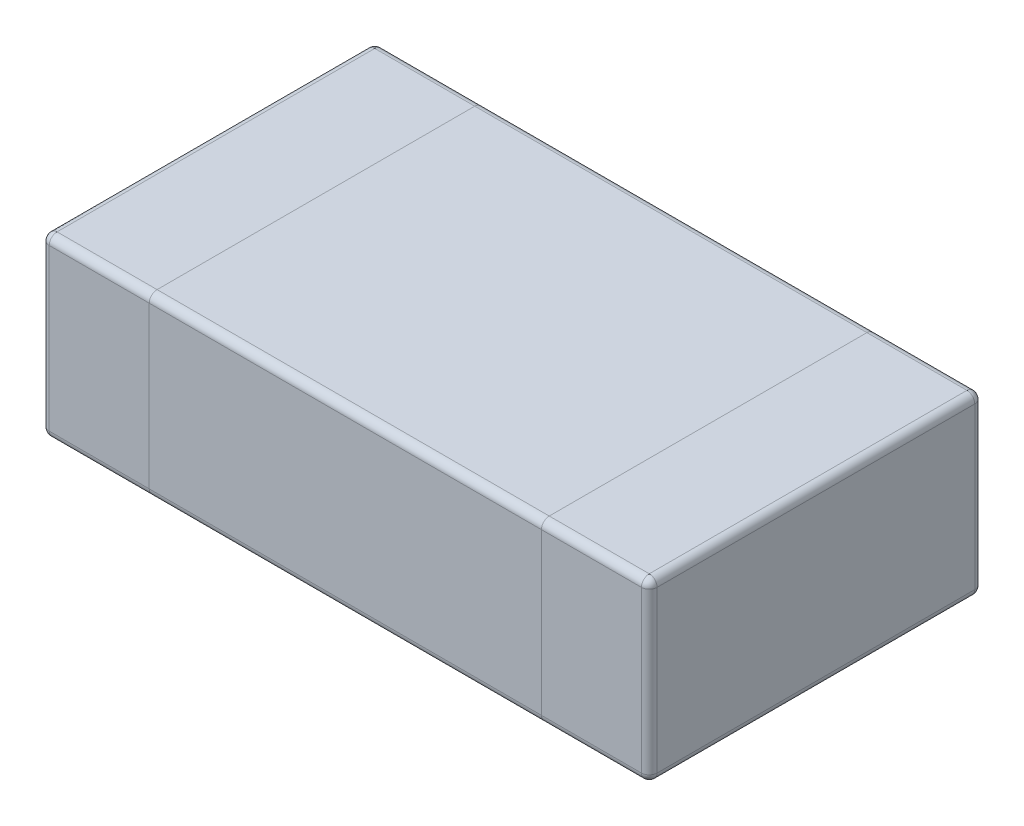
ISO-10303-21;
HEADER;
FILE_DESCRIPTION(('STEP AP214'),'2;1');
FILE_NAME('part.step','',(''),(''),'','','');
FILE_SCHEMA(('AUTOMOTIVE_DESIGN { 1 0 10303 214 1 1 1 1 }'));
ENDSEC;
DATA;
#1=APPLICATION_CONTEXT('core data for automotive mechanical design processes');
#2=APPLICATION_PROTOCOL_DEFINITION('international standard','automotive_design',2000,#1);
#3=PRODUCT_CONTEXT('',#1,'mechanical');
#4=PRODUCT('Part','Part','',(#3));
#5=PRODUCT_RELATED_PRODUCT_CATEGORY('part','',(#4));
#6=PRODUCT_DEFINITION_FORMATION('','',#4);
#7=PRODUCT_DEFINITION_CONTEXT('part definition',#1,'design');
#8=PRODUCT_DEFINITION('design','',#6,#7);
#9=PRODUCT_DEFINITION_SHAPE('','',#8);
#10=(LENGTH_UNIT() NAMED_UNIT(*) SI_UNIT(.MILLI.,.METRE.));
#11=(NAMED_UNIT(*) PLANE_ANGLE_UNIT() SI_UNIT($,.RADIAN.));
#12=(NAMED_UNIT(*) SI_UNIT($,.STERADIAN.) SOLID_ANGLE_UNIT());
#13=UNCERTAINTY_MEASURE_WITH_UNIT(LENGTH_MEASURE(1.E-05),#10,'distance_accuracy_value','');
#14=(GEOMETRIC_REPRESENTATION_CONTEXT(3) GLOBAL_UNCERTAINTY_ASSIGNED_CONTEXT((#13)) GLOBAL_UNIT_ASSIGNED_CONTEXT((#10,
#11,#12)) REPRESENTATION_CONTEXT('',''));
#15=CARTESIAN_POINT('',(0.,0.,0.));
#16=DIRECTION('',(0.,0.,1.));
#17=DIRECTION('',(1.,0.,0.));
#18=AXIS2_PLACEMENT_3D('',#15,#16,#17);
#19=CARTESIAN_POINT('',(-0.755,-0.225,0.405));
#20=DIRECTION('',(0.,1.,0.));
#21=DIRECTION('',(0.,0.,1.));
#22=AXIS2_PLACEMENT_3D('',#19,#20,#21);
#23=PLANE('',#22);
#24=DIRECTION('',(0.,0.,-1.));
#25=VECTOR('',#24,1.);
#26=CARTESIAN_POINT('',(-0.5,-0.225,0.405));
#27=LINE('',#26,#25);
#28=CARTESIAN_POINT('',(-0.5,-0.225,0.405));
#29=VERTEX_POINT('',#28);
#30=CARTESIAN_POINT('',(-0.5,-0.225,-0.405));
#31=VERTEX_POINT('',#30);
#32=EDGE_CURVE('E209',#29,#31,#27,.T.);
#33=ORIENTED_EDGE('',*,*,#32,.F.);
#34=DIRECTION('',(1.,0.,0.));
#35=VECTOR('',#34,1.);
#36=CARTESIAN_POINT('',(-0.755,-0.225,0.405));
#37=LINE('',#36,#35);
#38=CARTESIAN_POINT('',(-0.755,-0.225,0.405));
#39=VERTEX_POINT('',#38);
#40=EDGE_CURVE('E232',#29,#39,#37,.F.);
#41=ORIENTED_EDGE('',*,*,#40,.T.);
#42=DIRECTION('',(0.,0.,1.));
#43=VECTOR('',#42,1.);
#44=CARTESIAN_POINT('',(-0.755,-0.225,0.405));
#45=LINE('',#44,#43);
#46=CARTESIAN_POINT('',(-0.755,-0.225,-0.405));
#47=VERTEX_POINT('',#46);
#48=EDGE_CURVE('E230',#39,#47,#45,.F.);
#49=ORIENTED_EDGE('',*,*,#48,.T.);
#50=DIRECTION('',(-1.,0.,0.));
#51=VECTOR('',#50,1.);
#52=CARTESIAN_POINT('',(-0.755,-0.225,-0.405));
#53=LINE('',#52,#51);
#54=EDGE_CURVE('E228',#47,#31,#53,.F.);
#55=ORIENTED_EDGE('',*,*,#54,.T.);
#56=EDGE_LOOP('',(#33,#41,#49,#55));
#57=FACE_BOUND('',#56,.T.);
#58=ADVANCED_FACE('F38',(#57),#23,.F.);
#59=DIRECTION('',(0.,0.,-1.));
#60=VECTOR('',#59,1.);
#61=CARTESIAN_POINT('',(0.5,-0.225,0.405));
#62=LINE('',#61,#60);
#63=CARTESIAN_POINT('',(0.5,-0.225,0.405));
#64=VERTEX_POINT('',#63);
#65=CARTESIAN_POINT('',(0.5,-0.225,-0.405));
#66=VERTEX_POINT('',#65);
#67=EDGE_CURVE('E215',#64,#66,#62,.T.);
#68=ORIENTED_EDGE('',*,*,#67,.F.);
#69=DIRECTION('',(1.,0.,0.));
#70=VECTOR('',#69,1.);
#71=CARTESIAN_POINT('',(-0.755,-0.225,0.405));
#72=LINE('',#71,#70);
#73=EDGE_CURVE('E220',#64,#29,#72,.F.);
#74=ORIENTED_EDGE('',*,*,#73,.T.);
#75=ORIENTED_EDGE('',*,*,#32,.T.);
#76=DIRECTION('',(-1.,0.,0.));
#77=VECTOR('',#76,1.);
#78=CARTESIAN_POINT('',(-0.755,-0.225,-0.405));
#79=LINE('',#78,#77);
#80=EDGE_CURVE('E211',#31,#66,#79,.F.);
#81=ORIENTED_EDGE('',*,*,#80,.T.);
#82=EDGE_LOOP('',(#68,#74,#75,#81));
#83=FACE_BOUND('',#82,.T.);
#84=ADVANCED_FACE('F446',(#83),#23,.F.);
#85=CARTESIAN_POINT('',(-0.755,0.225,-0.425));
#86=DIRECTION('',(0.,0.,1.));
#87=DIRECTION('',(1.,0.,0.));
#88=AXIS2_PLACEMENT_3D('',#85,#86,#87);
#89=PLANE('',#88);
#90=DIRECTION('',(0.,-1.,0.));
#91=VECTOR('',#90,1.);
#92=CARTESIAN_POINT('',(0.5,0.225,-0.425));
#93=LINE('',#92,#91);
#94=CARTESIAN_POINT('',(0.5,0.205,-0.425));
#95=VERTEX_POINT('',#94);
#96=CARTESIAN_POINT('',(0.5,-0.205,-0.425));
#97=VERTEX_POINT('',#96);
#98=EDGE_CURVE('E195',#95,#97,#93,.T.);
#99=ORIENTED_EDGE('',*,*,#98,.T.);
#100=DIRECTION('',(-1.,0.,0.));
#101=VECTOR('',#100,1.);
#102=CARTESIAN_POINT('',(-0.755,-0.205,-0.425));
#103=LINE('',#102,#101);
#104=CARTESIAN_POINT('',(-0.5,-0.205,-0.425));
#105=VERTEX_POINT('',#104);
#106=EDGE_CURVE('E252',#97,#105,#103,.T.);
#107=ORIENTED_EDGE('',*,*,#106,.T.);
#108=DIRECTION('',(0.,-1.,0.));
#109=VECTOR('',#108,1.);
#110=CARTESIAN_POINT('',(-0.5,0.225,-0.425));
#111=LINE('',#110,#109);
#112=CARTESIAN_POINT('',(-0.5,0.205,-0.425));
#113=VERTEX_POINT('',#112);
#114=EDGE_CURVE('E402',#113,#105,#111,.T.);
#115=ORIENTED_EDGE('',*,*,#114,.F.);
#116=DIRECTION('',(-1.,0.,0.));
#117=VECTOR('',#116,1.);
#118=CARTESIAN_POINT('',(0.5,0.205,-0.425));
#119=LINE('',#118,#117);
#120=EDGE_CURVE('E250',#113,#95,#119,.F.);
#121=ORIENTED_EDGE('',*,*,#120,.T.);
#122=EDGE_LOOP('',(#99,#107,#115,#121));
#123=FACE_BOUND('',#122,.T.);
#124=ADVANCED_FACE('F507',(#123),#89,.F.);
#125=DIRECTION('',(0.,-1.,0.));
#126=VECTOR('',#125,1.);
#127=CARTESIAN_POINT('',(0.755,0.225,-0.425));
#128=LINE('',#127,#126);
#129=CARTESIAN_POINT('',(0.755,0.205,-0.425));
#130=VERTEX_POINT('',#129);
#131=CARTESIAN_POINT('',(0.755,-0.205,-0.425));
#132=VERTEX_POINT('',#131);
#133=EDGE_CURVE('E367',#130,#132,#128,.T.);
#134=ORIENTED_EDGE('',*,*,#133,.T.);
#135=DIRECTION('',(-1.,0.,0.));
#136=VECTOR('',#135,1.);
#137=CARTESIAN_POINT('',(-0.755,-0.205,-0.425));
#138=LINE('',#137,#136);
#139=EDGE_CURVE('E256',#132,#97,#138,.T.);
#140=ORIENTED_EDGE('',*,*,#139,.T.);
#141=ORIENTED_EDGE('',*,*,#98,.F.);
#142=DIRECTION('',(-1.,0.,0.));
#143=VECTOR('',#142,1.);
#144=CARTESIAN_POINT('',(0.755,0.205,-0.425));
#145=LINE('',#144,#143);
#146=EDGE_CURVE('E254',#95,#130,#145,.F.);
#147=ORIENTED_EDGE('',*,*,#146,.T.);
#148=EDGE_LOOP('',(#134,#140,#141,#147));
#149=FACE_BOUND('',#148,.T.);
#150=ADVANCED_FACE('F366',(#149),#89,.F.);
#151=CARTESIAN_POINT('',(-0.755,0.225,0.425));
#152=DIRECTION('',(0.,0.,-1.));
#153=DIRECTION('',(-1.,0.,0.));
#154=AXIS2_PLACEMENT_3D('',#151,#152,#153);
#155=PLANE('',#154);
#156=DIRECTION('',(0.,-1.,0.));
#157=VECTOR('',#156,1.);
#158=CARTESIAN_POINT('',(-0.5,0.225,0.425));
#159=LINE('',#158,#157);
#160=CARTESIAN_POINT('',(-0.5,0.205,0.425));
#161=VERTEX_POINT('',#160);
#162=CARTESIAN_POINT('',(-0.5,-0.205,0.425));
#163=VERTEX_POINT('',#162);
#164=EDGE_CURVE('E196',#161,#163,#159,.T.);
#165=ORIENTED_EDGE('',*,*,#164,.T.);
#166=DIRECTION('',(1.,0.,0.));
#167=VECTOR('',#166,1.);
#168=CARTESIAN_POINT('',(-0.755,-0.205,0.425));
#169=LINE('',#168,#167);
#170=CARTESIAN_POINT('',(0.5,-0.205,0.425));
#171=VERTEX_POINT('',#170);
#172=EDGE_CURVE('E193',#163,#171,#169,.T.);
#173=ORIENTED_EDGE('',*,*,#172,.T.);
#174=DIRECTION('',(0.,-1.,0.));
#175=VECTOR('',#174,1.);
#176=CARTESIAN_POINT('',(0.5,0.225,0.425));
#177=LINE('',#176,#175);
#178=CARTESIAN_POINT('',(0.5,0.205,0.425));
#179=VERTEX_POINT('',#178);
#180=EDGE_CURVE('E178',#179,#171,#177,.T.);
#181=ORIENTED_EDGE('',*,*,#180,.F.);
#182=DIRECTION('',(1.,0.,0.));
#183=VECTOR('',#182,1.);
#184=CARTESIAN_POINT('',(-0.5,0.205,0.425));
#185=LINE('',#184,#183);
#186=EDGE_CURVE('E190',#179,#161,#185,.F.);
#187=ORIENTED_EDGE('',*,*,#186,.T.);
#188=EDGE_LOOP('',(#165,#173,#181,#187));
#189=FACE_BOUND('',#188,.T.);
#190=ADVANCED_FACE('F188',(#189),#155,.F.);
#191=DIRECTION('',(0.,-1.,0.));
#192=VECTOR('',#191,1.);
#193=CARTESIAN_POINT('',(-0.755,0.225,0.425));
#194=LINE('',#193,#192);
#195=CARTESIAN_POINT('',(-0.755,0.205,0.425));
#196=VERTEX_POINT('',#195);
#197=CARTESIAN_POINT('',(-0.755,-0.205,0.425));
#198=VERTEX_POINT('',#197);
#199=EDGE_CURVE('E388',#196,#198,#194,.T.);
#200=ORIENTED_EDGE('',*,*,#199,.T.);
#201=DIRECTION('',(1.,0.,0.));
#202=VECTOR('',#201,1.);
#203=CARTESIAN_POINT('',(-0.755,-0.205,0.425));
#204=LINE('',#203,#202);
#205=EDGE_CURVE('E226',#198,#163,#204,.T.);
#206=ORIENTED_EDGE('',*,*,#205,.T.);
#207=ORIENTED_EDGE('',*,*,#164,.F.);
#208=DIRECTION('',(1.,0.,0.));
#209=VECTOR('',#208,1.);
#210=CARTESIAN_POINT('',(-0.755,0.205,0.425));
#211=LINE('',#210,#209);
#212=EDGE_CURVE('E223',#161,#196,#211,.F.);
#213=ORIENTED_EDGE('',*,*,#212,.T.);
#214=EDGE_LOOP('',(#200,#206,#207,#213));
#215=FACE_BOUND('',#214,.T.);
#216=ADVANCED_FACE('F482',(#215),#155,.F.);
#217=CARTESIAN_POINT('',(-0.755,0.225,0.405));
#218=DIRECTION('',(0.,1.,0.));
#219=DIRECTION('',(0.,0.,1.));
#220=AXIS2_PLACEMENT_3D('',#217,#218,#219);
#221=PLANE('',#220);
#222=DIRECTION('',(0.,0.,-1.));
#223=VECTOR('',#222,1.);
#224=CARTESIAN_POINT('',(0.755,0.225,-0.405));
#225=LINE('',#224,#223);
#226=CARTESIAN_POINT('',(0.755,0.225,0.405));
#227=VERTEX_POINT('',#226);
#228=CARTESIAN_POINT('',(0.755,0.225,-0.405));
#229=VERTEX_POINT('',#228);
#230=EDGE_CURVE('E55',#227,#229,#225,.T.);
#231=ORIENTED_EDGE('',*,*,#230,.T.);
#232=DIRECTION('',(-1.,0.,0.));
#233=VECTOR('',#232,1.);
#234=CARTESIAN_POINT('',(0.5,0.225,-0.405));
#235=LINE('',#234,#233);
#236=CARTESIAN_POINT('',(0.5,0.225,-0.405));
#237=VERTEX_POINT('',#236);
#238=EDGE_CURVE('E289',#229,#237,#235,.T.);
#239=ORIENTED_EDGE('',*,*,#238,.T.);
#240=DIRECTION('',(0.,0.,1.));
#241=VECTOR('',#240,1.);
#242=CARTESIAN_POINT('',(0.5,0.225,0.405));
#243=LINE('',#242,#241);
#244=CARTESIAN_POINT('',(0.5,0.225,0.405));
#245=VERTEX_POINT('',#244);
#246=EDGE_CURVE('E395',#237,#245,#243,.T.);
#247=ORIENTED_EDGE('',*,*,#246,.T.);
#248=DIRECTION('',(1.,0.,0.));
#249=VECTOR('',#248,1.);
#250=CARTESIAN_POINT('',(0.755,0.225,0.405));
#251=LINE('',#250,#249);
#252=EDGE_CURVE('E60',#245,#227,#251,.T.);
#253=ORIENTED_EDGE('',*,*,#252,.T.);
#254=EDGE_LOOP('',(#231,#239,#247,#253));
#255=FACE_BOUND('',#254,.T.);
#256=ADVANCED_FACE('F493',(#255),#221,.T.);
#257=ORIENTED_EDGE('',*,*,#246,.F.);
#258=DIRECTION('',(-1.,0.,0.));
#259=VECTOR('',#258,1.);
#260=CARTESIAN_POINT('',(-0.5,0.225,-0.405));
#261=LINE('',#260,#259);
#262=CARTESIAN_POINT('',(-0.5,0.225,-0.405));
#263=VERTEX_POINT('',#262);
#264=EDGE_CURVE('E285',#237,#263,#261,.T.);
#265=ORIENTED_EDGE('',*,*,#264,.T.);
#266=DIRECTION('',(0.,0.,1.));
#267=VECTOR('',#266,1.);
#268=CARTESIAN_POINT('',(-0.5,0.225,0.405));
#269=LINE('',#268,#267);
#270=CARTESIAN_POINT('',(-0.5,0.225,0.405));
#271=VERTEX_POINT('',#270);
#272=EDGE_CURVE('E391',#263,#271,#269,.T.);
#273=ORIENTED_EDGE('',*,*,#272,.T.);
#274=DIRECTION('',(1.,0.,0.));
#275=VECTOR('',#274,1.);
#276=CARTESIAN_POINT('',(0.5,0.225,0.405));
#277=LINE('',#276,#275);
#278=EDGE_CURVE('E283',#271,#245,#277,.T.);
#279=ORIENTED_EDGE('',*,*,#278,.T.);
#280=EDGE_LOOP('',(#257,#265,#273,#279));
#281=FACE_BOUND('',#280,.T.);
#282=ADVANCED_FACE('F492',(#281),#221,.T.);
#283=CARTESIAN_POINT('',(-0.755,0.225,0.405));
#284=DIRECTION('',(0.,-1.,0.));
#285=DIRECTION('',(0.,0.,-1.));
#286=AXIS2_PLACEMENT_3D('',#283,#284,#285);
#287=CYLINDRICAL_SURFACE('',#286,0.0200000000000001);
#288=DIRECTION('',(0.,-1.,0.));
#289=VECTOR('',#288,1.);
#290=CARTESIAN_POINT('',(-0.775,0.225,0.405));
#291=LINE('',#290,#289);
#292=CARTESIAN_POINT('',(-0.775,0.205,0.405));
#293=VERTEX_POINT('',#292);
#294=CARTESIAN_POINT('',(-0.775,-0.205,0.405));
#295=VERTEX_POINT('',#294);
#296=EDGE_CURVE('E326',#293,#295,#291,.T.);
#297=ORIENTED_EDGE('',*,*,#296,.T.);
#298=CARTESIAN_POINT('',(-0.755,-0.205,0.405));
#299=DIRECTION('',(0.,-1.,0.));
#300=DIRECTION('',(0.,0.,-1.));
#301=AXIS2_PLACEMENT_3D('',#298,#299,#300);
#302=CIRCLE('',#301,0.0200000000000001);
#303=EDGE_CURVE('E236',#295,#198,#302,.F.);
#304=ORIENTED_EDGE('',*,*,#303,.T.);
#305=ORIENTED_EDGE('',*,*,#199,.F.);
#306=CARTESIAN_POINT('',(-0.755,0.205,0.405));
#307=DIRECTION('',(0.,-1.,0.));
#308=DIRECTION('',(0.,0.,-1.));
#309=AXIS2_PLACEMENT_3D('',#306,#307,#308);
#310=CIRCLE('',#309,0.0200000000000001);
#311=EDGE_CURVE('E234',#196,#293,#310,.T.);
#312=ORIENTED_EDGE('',*,*,#311,.T.);
#313=EDGE_LOOP('',(#297,#304,#305,#312));
#314=FACE_BOUND('',#313,.T.);
#315=ADVANCED_FACE('F471',(#314),#287,.T.);
#316=DIRECTION('',(0.,-1.,0.));
#317=VECTOR('',#316,1.);
#318=CARTESIAN_POINT('',(0.755,0.225,0.425));
#319=LINE('',#318,#317);
#320=CARTESIAN_POINT('',(0.755,0.205,0.425));
#321=VERTEX_POINT('',#320);
#322=CARTESIAN_POINT('',(0.755,-0.205,0.425));
#323=VERTEX_POINT('',#322);
#324=EDGE_CURVE('E180',#321,#323,#319,.T.);
#325=ORIENTED_EDGE('',*,*,#324,.F.);
#326=DIRECTION('',(1.,0.,0.));
#327=VECTOR('',#326,1.);
#328=CARTESIAN_POINT('',(0.5,0.205,0.425));
#329=LINE('',#328,#327);
#330=EDGE_CURVE('E11',#321,#179,#329,.F.);
#331=ORIENTED_EDGE('',*,*,#330,.T.);
#332=ORIENTED_EDGE('',*,*,#180,.T.);
#333=DIRECTION('',(1.,0.,0.));
#334=VECTOR('',#333,1.);
#335=CARTESIAN_POINT('',(-0.755,-0.205,0.425));
#336=LINE('',#335,#334);
#337=EDGE_CURVE('E47',#171,#323,#336,.T.);
#338=ORIENTED_EDGE('',*,*,#337,.T.);
#339=EDGE_LOOP('',(#325,#331,#332,#338));
#340=FACE_BOUND('',#339,.T.);
#341=ADVANCED_FACE('F177',(#340),#155,.F.);
#342=CARTESIAN_POINT('',(0.755,0.225,0.405));
#343=DIRECTION('',(0.,-1.,0.));
#344=DIRECTION('',(0.,0.,-1.));
#345=AXIS2_PLACEMENT_3D('',#342,#343,#344);
#346=CYLINDRICAL_SURFACE('',#345,0.0200000000000001);
#347=ORIENTED_EDGE('',*,*,#324,.T.);
#348=CARTESIAN_POINT('',(0.755,-0.205,0.405));
#349=DIRECTION('',(0.,-1.,0.));
#350=DIRECTION('',(0.,0.,-1.));
#351=AXIS2_PLACEMENT_3D('',#348,#349,#350);
#352=CIRCLE('',#351,0.0200000000000001);
#353=CARTESIAN_POINT('',(0.775,-0.205,0.405));
#354=VERTEX_POINT('',#353);
#355=EDGE_CURVE('E274',#323,#354,#352,.F.);
#356=ORIENTED_EDGE('',*,*,#355,.T.);
#357=DIRECTION('',(0.,-1.,0.));
#358=VECTOR('',#357,1.);
#359=CARTESIAN_POINT('',(0.775,0.225,0.405));
#360=LINE('',#359,#358);
#361=CARTESIAN_POINT('',(0.775,0.205,0.405));
#362=VERTEX_POINT('',#361);
#363=EDGE_CURVE('E378',#362,#354,#360,.T.);
#364=ORIENTED_EDGE('',*,*,#363,.F.);
#365=CARTESIAN_POINT('',(0.755,0.205,0.405));
#366=DIRECTION('',(0.,-1.,0.));
#367=DIRECTION('',(0.,0.,-1.));
#368=AXIS2_PLACEMENT_3D('',#365,#366,#367);
#369=CIRCLE('',#368,0.0200000000000001);
#370=EDGE_CURVE('E272',#362,#321,#369,.T.);
#371=ORIENTED_EDGE('',*,*,#370,.T.);
#372=EDGE_LOOP('',(#347,#356,#364,#371));
#373=FACE_BOUND('',#372,.T.);
#374=ADVANCED_FACE('F832',(#373),#346,.T.);
#375=CARTESIAN_POINT('',(0.775,0.225,0.405));
#376=DIRECTION('',(-1.,0.,0.));
#377=DIRECTION('',(0.,0.,1.));
#378=AXIS2_PLACEMENT_3D('',#375,#376,#377);
#379=PLANE('',#378);
#380=ORIENTED_EDGE('',*,*,#363,.T.);
#381=DIRECTION('',(0.,0.,-1.));
#382=VECTOR('',#381,1.);
#383=CARTESIAN_POINT('',(0.775,-0.205,0.405));
#384=LINE('',#383,#382);
#385=CARTESIAN_POINT('',(0.775,-0.205,-0.405));
#386=VERTEX_POINT('',#385);
#387=EDGE_CURVE('E270',#354,#386,#384,.T.);
#388=ORIENTED_EDGE('',*,*,#387,.T.);
#389=DIRECTION('',(0.,-1.,0.));
#390=VECTOR('',#389,1.);
#391=CARTESIAN_POINT('',(0.775,0.225,-0.405));
#392=LINE('',#391,#390);
#393=CARTESIAN_POINT('',(0.775,0.205,-0.405));
#394=VERTEX_POINT('',#393);
#395=EDGE_CURVE('E375',#394,#386,#392,.T.);
#396=ORIENTED_EDGE('',*,*,#395,.F.);
#397=DIRECTION('',(0.,0.,-1.));
#398=VECTOR('',#397,1.);
#399=CARTESIAN_POINT('',(0.775,0.205,0.405));
#400=LINE('',#399,#398);
#401=EDGE_CURVE('E268',#394,#362,#400,.F.);
#402=ORIENTED_EDGE('',*,*,#401,.T.);
#403=EDGE_LOOP('',(#380,#388,#396,#402));
#404=FACE_BOUND('',#403,.T.);
#405=ADVANCED_FACE('F822',(#404),#379,.F.);
#406=CARTESIAN_POINT('',(0.755,0.225,-0.405));
#407=DIRECTION('',(0.,-1.,0.));
#408=DIRECTION('',(0.,0.,-1.));
#409=AXIS2_PLACEMENT_3D('',#406,#407,#408);
#410=CYLINDRICAL_SURFACE('',#409,0.0200000000000001);
#411=ORIENTED_EDGE('',*,*,#395,.T.);
#412=CARTESIAN_POINT('',(0.755,-0.205,-0.405));
#413=DIRECTION('',(0.,-1.,0.));
#414=DIRECTION('',(0.,0.,-1.));
#415=AXIS2_PLACEMENT_3D('',#412,#413,#414);
#416=CIRCLE('',#415,0.0200000000000001);
#417=EDGE_CURVE('E266',#386,#132,#416,.F.);
#418=ORIENTED_EDGE('',*,*,#417,.T.);
#419=ORIENTED_EDGE('',*,*,#133,.F.);
#420=CARTESIAN_POINT('',(0.755,0.205,-0.405));
#421=DIRECTION('',(0.,-1.,0.));
#422=DIRECTION('',(0.,0.,-1.));
#423=AXIS2_PLACEMENT_3D('',#420,#421,#422);
#424=CIRCLE('',#423,0.0200000000000001);
#425=EDGE_CURVE('E264',#130,#394,#424,.T.);
#426=ORIENTED_EDGE('',*,*,#425,.T.);
#427=EDGE_LOOP('',(#411,#418,#419,#426));
#428=FACE_BOUND('',#427,.T.);
#429=ADVANCED_FACE('F372',(#428),#410,.T.);
#430=ORIENTED_EDGE('',*,*,#114,.T.);
#431=DIRECTION('',(-1.,0.,0.));
#432=VECTOR('',#431,1.);
#433=CARTESIAN_POINT('',(-0.755,-0.205,-0.425));
#434=LINE('',#433,#432);
#435=CARTESIAN_POINT('',(-0.755,-0.205,-0.425));
#436=VERTEX_POINT('',#435);
#437=EDGE_CURVE('E248',#105,#436,#434,.T.);
#438=ORIENTED_EDGE('',*,*,#437,.T.);
#439=DIRECTION('',(0.,-1.,0.));
#440=VECTOR('',#439,1.);
#441=CARTESIAN_POINT('',(-0.755,0.225,-0.425));
#442=LINE('',#441,#440);
#443=CARTESIAN_POINT('',(-0.755,0.205,-0.425));
#444=VERTEX_POINT('',#443);
#445=EDGE_CURVE('E376',#444,#436,#442,.T.);
#446=ORIENTED_EDGE('',*,*,#445,.F.);
#447=DIRECTION('',(-1.,0.,0.));
#448=VECTOR('',#447,1.);
#449=CARTESIAN_POINT('',(-0.5,0.205,-0.425));
#450=LINE('',#449,#448);
#451=EDGE_CURVE('E246',#444,#113,#450,.F.);
#452=ORIENTED_EDGE('',*,*,#451,.T.);
#453=EDGE_LOOP('',(#430,#438,#446,#452));
#454=FACE_BOUND('',#453,.T.);
#455=ADVANCED_FACE('F799',(#454),#89,.F.);
#456=CARTESIAN_POINT('',(-0.755,0.225,-0.405));
#457=DIRECTION('',(0.,-1.,0.));
#458=DIRECTION('',(0.,0.,-1.));
#459=AXIS2_PLACEMENT_3D('',#456,#457,#458);
#460=CYLINDRICAL_SURFACE('',#459,0.0200000000000001);
#461=ORIENTED_EDGE('',*,*,#445,.T.);
#462=CARTESIAN_POINT('',(-0.755,-0.205,-0.405));
#463=DIRECTION('',(0.,-1.,0.));
#464=DIRECTION('',(0.,0.,-1.));
#465=AXIS2_PLACEMENT_3D('',#462,#463,#464);
#466=CIRCLE('',#465,0.0200000000000001);
#467=CARTESIAN_POINT('',(-0.775,-0.205,-0.405));
#468=VERTEX_POINT('',#467);
#469=EDGE_CURVE('E244',#436,#468,#466,.F.);
#470=ORIENTED_EDGE('',*,*,#469,.T.);
#471=DIRECTION('',(0.,-1.,0.));
#472=VECTOR('',#471,1.);
#473=CARTESIAN_POINT('',(-0.775,0.225,-0.405));
#474=LINE('',#473,#472);
#475=CARTESIAN_POINT('',(-0.775,0.205,-0.405));
#476=VERTEX_POINT('',#475);
#477=EDGE_CURVE('E381',#476,#468,#474,.T.);
#478=ORIENTED_EDGE('',*,*,#477,.F.);
#479=CARTESIAN_POINT('',(-0.755,0.205,-0.405));
#480=DIRECTION('',(0.,-1.,0.));
#481=DIRECTION('',(0.,0.,-1.));
#482=AXIS2_PLACEMENT_3D('',#479,#480,#481);
#483=CIRCLE('',#482,0.0200000000000001);
#484=EDGE_CURVE('E242',#476,#444,#483,.T.);
#485=ORIENTED_EDGE('',*,*,#484,.T.);
#486=EDGE_LOOP('',(#461,#470,#478,#485));
#487=FACE_BOUND('',#486,.T.);
#488=ADVANCED_FACE('F789',(#487),#460,.T.);
#489=CARTESIAN_POINT('',(-0.775,0.225,0.405));
#490=DIRECTION('',(1.,0.,0.));
#491=DIRECTION('',(0.,0.,-1.));
#492=AXIS2_PLACEMENT_3D('',#489,#490,#491);
#493=PLANE('',#492);
#494=ORIENTED_EDGE('',*,*,#477,.T.);
#495=DIRECTION('',(0.,0.,1.));
#496=VECTOR('',#495,1.);
#497=CARTESIAN_POINT('',(-0.775,-0.205,0.405));
#498=LINE('',#497,#496);
#499=EDGE_CURVE('E240',#468,#295,#498,.T.);
#500=ORIENTED_EDGE('',*,*,#499,.T.);
#501=ORIENTED_EDGE('',*,*,#296,.F.);
#502=DIRECTION('',(0.,0.,1.));
#503=VECTOR('',#502,1.);
#504=CARTESIAN_POINT('',(-0.775,0.205,-0.405));
#505=LINE('',#504,#503);
#506=EDGE_CURVE('E238',#293,#476,#505,.F.);
#507=ORIENTED_EDGE('',*,*,#506,.T.);
#508=EDGE_LOOP('',(#494,#500,#501,#507));
#509=FACE_BOUND('',#508,.T.);
#510=ADVANCED_FACE('F467',(#509),#493,.F.);
#511=DIRECTION('',(0.,0.,1.));
#512=VECTOR('',#511,1.);
#513=CARTESIAN_POINT('',(-0.755,0.225,0.405));
#514=LINE('',#513,#512);
#515=CARTESIAN_POINT('',(-0.755,0.225,-0.405));
#516=VERTEX_POINT('',#515);
#517=CARTESIAN_POINT('',(-0.755,0.225,0.405));
#518=VERTEX_POINT('',#517);
#519=EDGE_CURVE('E278',#516,#518,#514,.T.);
#520=ORIENTED_EDGE('',*,*,#519,.T.);
#521=DIRECTION('',(1.,0.,0.));
#522=VECTOR('',#521,1.);
#523=CARTESIAN_POINT('',(-0.5,0.225,0.405));
#524=LINE('',#523,#522);
#525=EDGE_CURVE('E280',#518,#271,#524,.T.);
#526=ORIENTED_EDGE('',*,*,#525,.T.);
#527=ORIENTED_EDGE('',*,*,#272,.F.);
#528=DIRECTION('',(-1.,0.,0.));
#529=VECTOR('',#528,1.);
#530=CARTESIAN_POINT('',(-0.755,0.225,-0.405));
#531=LINE('',#530,#529);
#532=EDGE_CURVE('E276',#263,#516,#531,.T.);
#533=ORIENTED_EDGE('',*,*,#532,.T.);
#534=EDGE_LOOP('',(#520,#526,#527,#533));
#535=FACE_BOUND('',#534,.T.);
#536=ADVANCED_FACE('F488',(#535),#221,.T.);
#537=ORIENTED_EDGE('',*,*,#67,.T.);
#538=DIRECTION('',(-1.,0.,0.));
#539=VECTOR('',#538,1.);
#540=CARTESIAN_POINT('',(-0.755,-0.225,-0.405));
#541=LINE('',#540,#539);
#542=CARTESIAN_POINT('',(0.755,-0.225,-0.405));
#543=VERTEX_POINT('',#542);
#544=EDGE_CURVE('E262',#66,#543,#541,.F.);
#545=ORIENTED_EDGE('',*,*,#544,.T.);
#546=DIRECTION('',(0.,0.,-1.));
#547=VECTOR('',#546,1.);
#548=CARTESIAN_POINT('',(0.755,-0.225,0.405));
#549=LINE('',#548,#547);
#550=CARTESIAN_POINT('',(0.755,-0.225,0.405));
#551=VERTEX_POINT('',#550);
#552=EDGE_CURVE('E260',#543,#551,#549,.F.);
#553=ORIENTED_EDGE('',*,*,#552,.T.);
#554=DIRECTION('',(1.,0.,0.));
#555=VECTOR('',#554,1.);
#556=CARTESIAN_POINT('',(-0.755,-0.225,0.405));
#557=LINE('',#556,#555);
#558=EDGE_CURVE('E258',#551,#64,#557,.F.);
#559=ORIENTED_EDGE('',*,*,#558,.T.);
#560=EDGE_LOOP('',(#537,#545,#553,#559));
#561=FACE_BOUND('',#560,.T.);
#562=ADVANCED_FACE('F412',(#561),#23,.F.);
#563=CARTESIAN_POINT('',(-0.755,-0.205,-0.405));
#564=DIRECTION('',(-1.,0.,0.));
#565=DIRECTION('',(0.,0.,1.));
#566=AXIS2_PLACEMENT_3D('',#563,#564,#565);
#567=CYLINDRICAL_SURFACE('',#566,0.02);
#568=CARTESIAN_POINT('',(0.5,-0.205,-0.405));
#569=DIRECTION('',(1.,0.,0.));
#570=DIRECTION('',(0.,0.,-1.));
#571=AXIS2_PLACEMENT_3D('',#568,#569,#570);
#572=CIRCLE('',#571,0.02);
#573=EDGE_CURVE('E320',#66,#97,#572,.T.);
#574=ORIENTED_EDGE('',*,*,#573,.F.);
#575=ORIENTED_EDGE('',*,*,#80,.F.);
#576=CARTESIAN_POINT('',(-0.5,-0.205,-0.405));
#577=DIRECTION('',(-1.,0.,0.));
#578=DIRECTION('',(0.,0.,1.));
#579=AXIS2_PLACEMENT_3D('',#576,#577,#578);
#580=CIRCLE('',#579,0.02);
#581=EDGE_CURVE('E323',#105,#31,#580,.T.);
#582=ORIENTED_EDGE('',*,*,#581,.F.);
#583=ORIENTED_EDGE('',*,*,#106,.F.);
#584=EDGE_LOOP('',(#574,#575,#582,#583));
#585=FACE_BOUND('',#584,.T.);
#586=ADVANCED_FACE('F421',(#585),#567,.T.);
#587=CARTESIAN_POINT('',(-0.755,-0.205,-0.405));
#588=DIRECTION('',(-1.,0.,0.));
#589=DIRECTION('',(0.,0.,1.));
#590=AXIS2_PLACEMENT_3D('',#587,#588,#589);
#591=CYLINDRICAL_SURFACE('',#590,0.02);
#592=ORIENTED_EDGE('',*,*,#581,.T.);
#593=ORIENTED_EDGE('',*,*,#54,.F.);
#594=CARTESIAN_POINT('',(-0.755,-0.205,-0.405));
#595=DIRECTION('',(-1.,0.,0.));
#596=DIRECTION('',(0.,0.,1.));
#597=AXIS2_PLACEMENT_3D('',#594,#595,#596);
#598=CIRCLE('',#597,0.02);
#599=EDGE_CURVE('E317',#436,#47,#598,.T.);
#600=ORIENTED_EDGE('',*,*,#599,.F.);
#601=ORIENTED_EDGE('',*,*,#437,.F.);
#602=EDGE_LOOP('',(#592,#593,#600,#601));
#603=FACE_BOUND('',#602,.T.);
#604=ADVANCED_FACE('F452',(#603),#591,.T.);
#605=CARTESIAN_POINT('',(-0.755,-0.205,-0.405));
#606=DIRECTION('',(-1.,0.,0.));
#607=DIRECTION('',(0.,0.,1.));
#608=AXIS2_PLACEMENT_3D('',#605,#606,#607);
#609=CYLINDRICAL_SURFACE('',#608,0.02);
#610=ORIENTED_EDGE('',*,*,#573,.T.);
#611=ORIENTED_EDGE('',*,*,#139,.F.);
#612=CARTESIAN_POINT('',(0.755,-0.205,-0.405));
#613=DIRECTION('',(1.,0.,0.));
#614=DIRECTION('',(0.,0.,-1.));
#615=AXIS2_PLACEMENT_3D('',#612,#613,#614);
#616=CIRCLE('',#615,0.02);
#617=EDGE_CURVE('E314',#543,#132,#616,.T.);
#618=ORIENTED_EDGE('',*,*,#617,.F.);
#619=ORIENTED_EDGE('',*,*,#544,.F.);
#620=EDGE_LOOP('',(#610,#611,#618,#619));
#621=FACE_BOUND('',#620,.T.);
#622=ADVANCED_FACE('F424',(#621),#609,.T.);
#623=CARTESIAN_POINT('',(-0.755,-0.205,-0.405));
#624=DIRECTION('',(0.,1.,0.));
#625=DIRECTION('',(0.,0.,1.));
#626=AXIS2_PLACEMENT_3D('',#623,#624,#625);
#627=SPHERICAL_SURFACE('',#626,0.02);
#628=ORIENTED_EDGE('',*,*,#469,.F.);
#629=ORIENTED_EDGE('',*,*,#599,.T.);
#630=CARTESIAN_POINT('',(-0.755,-0.205,-0.405));
#631=DIRECTION('',(0.,0.,1.));
#632=DIRECTION('',(1.,0.,0.));
#633=AXIS2_PLACEMENT_3D('',#630,#631,#632);
#634=CIRCLE('',#633,0.02);
#635=EDGE_CURVE('E311',#468,#47,#634,.T.);
#636=ORIENTED_EDGE('',*,*,#635,.F.);
#637=EDGE_LOOP('',(#628,#629,#636));
#638=FACE_BOUND('',#637,.T.);
#639=ADVANCED_FACE('F457',(#638),#627,.T.);
#640=CARTESIAN_POINT('',(0.755,-0.205,-0.405));
#641=DIRECTION('',(0.,1.,0.));
#642=DIRECTION('',(0.,0.,1.));
#643=AXIS2_PLACEMENT_3D('',#640,#641,#642);
#644=SPHERICAL_SURFACE('',#643,0.02);
#645=ORIENTED_EDGE('',*,*,#617,.T.);
#646=ORIENTED_EDGE('',*,*,#417,.F.);
#647=CARTESIAN_POINT('',(0.755,-0.205,-0.405));
#648=DIRECTION('',(0.,0.,1.));
#649=DIRECTION('',(1.,0.,0.));
#650=AXIS2_PLACEMENT_3D('',#647,#648,#649);
#651=CIRCLE('',#650,0.02);
#652=EDGE_CURVE('E308',#543,#386,#651,.T.);
#653=ORIENTED_EDGE('',*,*,#652,.F.);
#654=EDGE_LOOP('',(#645,#646,#653));
#655=FACE_BOUND('',#654,.T.);
#656=ADVANCED_FACE('F428',(#655),#644,.T.);
#657=CARTESIAN_POINT('',(-0.755,-0.205,0.405));
#658=DIRECTION('',(0.,0.,1.));
#659=DIRECTION('',(1.,0.,0.));
#660=AXIS2_PLACEMENT_3D('',#657,#658,#659);
#661=CYLINDRICAL_SURFACE('',#660,0.02);
#662=ORIENTED_EDGE('',*,*,#635,.T.);
#663=ORIENTED_EDGE('',*,*,#48,.F.);
#664=CARTESIAN_POINT('',(-0.755,-0.205,0.405));
#665=DIRECTION('',(0.,0.,1.));
#666=DIRECTION('',(1.,0.,0.));
#667=AXIS2_PLACEMENT_3D('',#664,#665,#666);
#668=CIRCLE('',#667,0.02);
#669=EDGE_CURVE('E305',#295,#39,#668,.T.);
#670=ORIENTED_EDGE('',*,*,#669,.F.);
#671=ORIENTED_EDGE('',*,*,#499,.F.);
#672=EDGE_LOOP('',(#662,#663,#670,#671));
#673=FACE_BOUND('',#672,.T.);
#674=ADVANCED_FACE('F460',(#673),#661,.T.);
#675=CARTESIAN_POINT('',(0.755,-0.205,0.405));
#676=DIRECTION('',(0.,0.,-1.));
#677=DIRECTION('',(-1.,0.,0.));
#678=AXIS2_PLACEMENT_3D('',#675,#676,#677);
#679=CYLINDRICAL_SURFACE('',#678,0.02);
#680=ORIENTED_EDGE('',*,*,#652,.T.);
#681=ORIENTED_EDGE('',*,*,#387,.F.);
#682=CARTESIAN_POINT('',(0.755,-0.205,0.405));
#683=DIRECTION('',(0.,0.,1.));
#684=DIRECTION('',(1.,0.,0.));
#685=AXIS2_PLACEMENT_3D('',#682,#683,#684);
#686=CIRCLE('',#685,0.02);
#687=EDGE_CURVE('E302',#551,#354,#686,.T.);
#688=ORIENTED_EDGE('',*,*,#687,.F.);
#689=ORIENTED_EDGE('',*,*,#552,.F.);
#690=EDGE_LOOP('',(#680,#681,#688,#689));
#691=FACE_BOUND('',#690,.T.);
#692=ADVANCED_FACE('F432',(#691),#679,.T.);
#693=CARTESIAN_POINT('',(-0.755,-0.205,0.405));
#694=DIRECTION('',(0.,1.,0.));
#695=DIRECTION('',(0.,0.,1.));
#696=AXIS2_PLACEMENT_3D('',#693,#694,#695);
#697=SPHERICAL_SURFACE('',#696,0.02);
#698=ORIENTED_EDGE('',*,*,#303,.F.);
#699=ORIENTED_EDGE('',*,*,#669,.T.);
#700=CARTESIAN_POINT('',(-0.755,-0.205,0.405));
#701=DIRECTION('',(1.,0.,0.));
#702=DIRECTION('',(0.,0.,-1.));
#703=AXIS2_PLACEMENT_3D('',#700,#701,#702);
#704=CIRCLE('',#703,0.02);
#705=EDGE_CURVE('E299',#198,#39,#704,.T.);
#706=ORIENTED_EDGE('',*,*,#705,.F.);
#707=EDGE_LOOP('',(#698,#699,#706));
#708=FACE_BOUND('',#707,.T.);
#709=ADVANCED_FACE('F570',(#708),#697,.T.);
#710=CARTESIAN_POINT('',(0.755,-0.205,0.405));
#711=DIRECTION('',(0.,1.,0.));
#712=DIRECTION('',(0.,0.,1.));
#713=AXIS2_PLACEMENT_3D('',#710,#711,#712);
#714=SPHERICAL_SURFACE('',#713,0.02);
#715=ORIENTED_EDGE('',*,*,#687,.T.);
#716=ORIENTED_EDGE('',*,*,#355,.F.);
#717=CARTESIAN_POINT('',(0.755,-0.205,0.405));
#718=DIRECTION('',(-1.,0.,0.));
#719=DIRECTION('',(0.,0.,1.));
#720=AXIS2_PLACEMENT_3D('',#717,#718,#719);
#721=CIRCLE('',#720,0.02);
#722=EDGE_CURVE('E296',#551,#323,#721,.T.);
#723=ORIENTED_EDGE('',*,*,#722,.F.);
#724=EDGE_LOOP('',(#715,#716,#723));
#725=FACE_BOUND('',#724,.T.);
#726=ADVANCED_FACE('F436',(#725),#714,.T.);
#727=CARTESIAN_POINT('',(-0.755,-0.205,0.405));
#728=DIRECTION('',(1.,0.,0.));
#729=DIRECTION('',(0.,0.,-1.));
#730=AXIS2_PLACEMENT_3D('',#727,#728,#729);
#731=CYLINDRICAL_SURFACE('',#730,0.02);
#732=ORIENTED_EDGE('',*,*,#705,.T.);
#733=ORIENTED_EDGE('',*,*,#40,.F.);
#734=CARTESIAN_POINT('',(-0.5,-0.205,0.405));
#735=DIRECTION('',(1.,0.,0.));
#736=DIRECTION('',(0.,0.,-1.));
#737=AXIS2_PLACEMENT_3D('',#734,#735,#736);
#738=CIRCLE('',#737,0.02);
#739=EDGE_CURVE('E294',#163,#29,#738,.T.);
#740=ORIENTED_EDGE('',*,*,#739,.F.);
#741=ORIENTED_EDGE('',*,*,#205,.F.);
#742=EDGE_LOOP('',(#732,#733,#740,#741));
#743=FACE_BOUND('',#742,.T.);
#744=ADVANCED_FACE('F561',(#743),#731,.T.);
#745=CARTESIAN_POINT('',(-0.755,-0.205,0.405));
#746=DIRECTION('',(1.,0.,0.));
#747=DIRECTION('',(0.,0.,-1.));
#748=AXIS2_PLACEMENT_3D('',#745,#746,#747);
#749=CYLINDRICAL_SURFACE('',#748,0.02);
#750=ORIENTED_EDGE('',*,*,#722,.T.);
#751=ORIENTED_EDGE('',*,*,#337,.F.);
#752=CARTESIAN_POINT('',(0.5,-0.205,0.405));
#753=DIRECTION('',(-1.,0.,0.));
#754=DIRECTION('',(0.,0.,1.));
#755=AXIS2_PLACEMENT_3D('',#752,#753,#754);
#756=CIRCLE('',#755,0.02);
#757=EDGE_CURVE('E292',#64,#171,#756,.T.);
#758=ORIENTED_EDGE('',*,*,#757,.F.);
#759=ORIENTED_EDGE('',*,*,#558,.F.);
#760=EDGE_LOOP('',(#750,#751,#758,#759));
#761=FACE_BOUND('',#760,.T.);
#762=ADVANCED_FACE('F440',(#761),#749,.T.);
#763=CARTESIAN_POINT('',(-0.755,-0.205,0.405));
#764=DIRECTION('',(1.,0.,0.));
#765=DIRECTION('',(0.,0.,-1.));
#766=AXIS2_PLACEMENT_3D('',#763,#764,#765);
#767=CYLINDRICAL_SURFACE('',#766,0.02);
#768=ORIENTED_EDGE('',*,*,#739,.T.);
#769=ORIENTED_EDGE('',*,*,#73,.F.);
#770=ORIENTED_EDGE('',*,*,#757,.T.);
#771=ORIENTED_EDGE('',*,*,#172,.F.);
#772=EDGE_LOOP('',(#768,#769,#770,#771));
#773=FACE_BOUND('',#772,.T.);
#774=ADVANCED_FACE('F442',(#773),#767,.T.);
#775=CARTESIAN_POINT('',(-0.755,0.205,-0.405));
#776=DIRECTION('',(1.,0.,0.));
#777=DIRECTION('',(0.,0.,-1.));
#778=AXIS2_PLACEMENT_3D('',#775,#776,#777);
#779=CYLINDRICAL_SURFACE('',#778,0.02);
#780=CARTESIAN_POINT('',(0.755,0.205,-0.405));
#781=DIRECTION('',(1.,0.,0.));
#782=DIRECTION('',(0.,0.,-1.));
#783=AXIS2_PLACEMENT_3D('',#780,#781,#782);
#784=CIRCLE('',#783,0.02);
#785=EDGE_CURVE('E347',#130,#229,#784,.T.);
#786=ORIENTED_EDGE('',*,*,#785,.F.);
#787=ORIENTED_EDGE('',*,*,#146,.F.);
#788=CARTESIAN_POINT('',(0.5,0.205,-0.405));
#789=DIRECTION('',(-1.,0.,0.));
#790=DIRECTION('',(0.,0.,1.));
#791=AXIS2_PLACEMENT_3D('',#788,#789,#790);
#792=CIRCLE('',#791,0.02);
#793=EDGE_CURVE('E42',#237,#95,#792,.T.);
#794=ORIENTED_EDGE('',*,*,#793,.F.);
#795=ORIENTED_EDGE('',*,*,#238,.F.);
#796=EDGE_LOOP('',(#786,#787,#794,#795));
#797=FACE_BOUND('',#796,.T.);
#798=ADVANCED_FACE('F40',(#797),#779,.T.);
#799=CARTESIAN_POINT('',(-0.755,0.205,-0.405));
#800=DIRECTION('',(1.,0.,0.));
#801=DIRECTION('',(0.,0.,-1.));
#802=AXIS2_PLACEMENT_3D('',#799,#800,#801);
#803=CYLINDRICAL_SURFACE('',#802,0.02);
#804=ORIENTED_EDGE('',*,*,#793,.T.);
#805=ORIENTED_EDGE('',*,*,#120,.F.);
#806=CARTESIAN_POINT('',(-0.5,0.205,-0.405));
#807=DIRECTION('',(-1.,0.,0.));
#808=DIRECTION('',(0.,0.,1.));
#809=AXIS2_PLACEMENT_3D('',#806,#807,#808);
#810=CIRCLE('',#809,0.02);
#811=EDGE_CURVE('E345',#263,#113,#810,.T.);
#812=ORIENTED_EDGE('',*,*,#811,.F.);
#813=ORIENTED_EDGE('',*,*,#264,.F.);
#814=EDGE_LOOP('',(#804,#805,#812,#813));
#815=FACE_BOUND('',#814,.T.);
#816=ADVANCED_FACE('F358',(#815),#803,.T.);
#817=CARTESIAN_POINT('',(0.755,0.205,-0.405));
#818=DIRECTION('',(0.,1.,0.));
#819=DIRECTION('',(0.,0.,1.));
#820=AXIS2_PLACEMENT_3D('',#817,#818,#819);
#821=SPHERICAL_SURFACE('',#820,0.02);
#822=ORIENTED_EDGE('',*,*,#425,.F.);
#823=ORIENTED_EDGE('',*,*,#785,.T.);
#824=CARTESIAN_POINT('',(0.755,0.205,-0.405));
#825=DIRECTION('',(0.,0.,1.));
#826=DIRECTION('',(1.,0.,0.));
#827=AXIS2_PLACEMENT_3D('',#824,#825,#826);
#828=CIRCLE('',#827,0.02);
#829=EDGE_CURVE('E342',#394,#229,#828,.T.);
#830=ORIENTED_EDGE('',*,*,#829,.F.);
#831=EDGE_LOOP('',(#822,#823,#830));
#832=FACE_BOUND('',#831,.T.);
#833=ADVANCED_FACE('F547',(#832),#821,.T.);
#834=CARTESIAN_POINT('',(-0.755,0.205,-0.405));
#835=DIRECTION('',(1.,0.,0.));
#836=DIRECTION('',(0.,0.,-1.));
#837=AXIS2_PLACEMENT_3D('',#834,#835,#836);
#838=CYLINDRICAL_SURFACE('',#837,0.02);
#839=ORIENTED_EDGE('',*,*,#811,.T.);
#840=ORIENTED_EDGE('',*,*,#451,.F.);
#841=CARTESIAN_POINT('',(-0.755,0.205,-0.405));
#842=DIRECTION('',(-1.,0.,0.));
#843=DIRECTION('',(0.,0.,1.));
#844=AXIS2_PLACEMENT_3D('',#841,#842,#843);
#845=CIRCLE('',#844,0.02);
#846=EDGE_CURVE('E339',#516,#444,#845,.T.);
#847=ORIENTED_EDGE('',*,*,#846,.F.);
#848=ORIENTED_EDGE('',*,*,#532,.F.);
#849=EDGE_LOOP('',(#839,#840,#847,#848));
#850=FACE_BOUND('',#849,.T.);
#851=ADVANCED_FACE('F543',(#850),#838,.T.);
#852=CARTESIAN_POINT('',(0.755,0.205,0.405));
#853=DIRECTION('',(0.,0.,1.));
#854=DIRECTION('',(1.,0.,0.));
#855=AXIS2_PLACEMENT_3D('',#852,#853,#854);
#856=CYLINDRICAL_SURFACE('',#855,0.02);
#857=ORIENTED_EDGE('',*,*,#829,.T.);
#858=ORIENTED_EDGE('',*,*,#230,.F.);
#859=CARTESIAN_POINT('',(0.755,0.205,0.405));
#860=DIRECTION('',(0.,0.,1.));
#861=DIRECTION('',(1.,0.,0.));
#862=AXIS2_PLACEMENT_3D('',#859,#860,#861);
#863=CIRCLE('',#862,0.02);
#864=EDGE_CURVE('E336',#362,#227,#863,.T.);
#865=ORIENTED_EDGE('',*,*,#864,.F.);
#866=ORIENTED_EDGE('',*,*,#401,.F.);
#867=EDGE_LOOP('',(#857,#858,#865,#866));
#868=FACE_BOUND('',#867,.T.);
#869=ADVANCED_FACE('F539',(#868),#856,.T.);
#870=CARTESIAN_POINT('',(-0.755,0.205,-0.405));
#871=DIRECTION('',(0.,1.,0.));
#872=DIRECTION('',(0.,0.,1.));
#873=AXIS2_PLACEMENT_3D('',#870,#871,#872);
#874=SPHERICAL_SURFACE('',#873,0.02);
#875=ORIENTED_EDGE('',*,*,#846,.T.);
#876=ORIENTED_EDGE('',*,*,#484,.F.);
#877=CARTESIAN_POINT('',(-0.755,0.205,-0.405));
#878=DIRECTION('',(0.,0.,1.));
#879=DIRECTION('',(1.,0.,0.));
#880=AXIS2_PLACEMENT_3D('',#877,#878,#879);
#881=CIRCLE('',#880,0.02);
#882=EDGE_CURVE('E333',#516,#476,#881,.T.);
#883=ORIENTED_EDGE('',*,*,#882,.F.);
#884=EDGE_LOOP('',(#875,#876,#883));
#885=FACE_BOUND('',#884,.T.);
#886=ADVANCED_FACE('F535',(#885),#874,.T.);
#887=CARTESIAN_POINT('',(0.755,0.205,0.405));
#888=DIRECTION('',(0.,1.,0.));
#889=DIRECTION('',(0.,0.,1.));
#890=AXIS2_PLACEMENT_3D('',#887,#888,#889);
#891=SPHERICAL_SURFACE('',#890,0.02);
#892=ORIENTED_EDGE('',*,*,#370,.F.);
#893=ORIENTED_EDGE('',*,*,#864,.T.);
#894=CARTESIAN_POINT('',(0.755,0.205,0.405));
#895=DIRECTION('',(-1.,0.,0.));
#896=DIRECTION('',(0.,0.,1.));
#897=AXIS2_PLACEMENT_3D('',#894,#895,#896);
#898=CIRCLE('',#897,0.02);
#899=EDGE_CURVE('E331',#321,#227,#898,.T.);
#900=ORIENTED_EDGE('',*,*,#899,.F.);
#901=EDGE_LOOP('',(#892,#893,#900));
#902=FACE_BOUND('',#901,.T.);
#903=ADVANCED_FACE('F531',(#902),#891,.T.);
#904=CARTESIAN_POINT('',(-0.755,0.205,0.405));
#905=DIRECTION('',(0.,0.,-1.));
#906=DIRECTION('',(-1.,0.,0.));
#907=AXIS2_PLACEMENT_3D('',#904,#905,#906);
#908=CYLINDRICAL_SURFACE('',#907,0.02);
#909=ORIENTED_EDGE('',*,*,#882,.T.);
#910=ORIENTED_EDGE('',*,*,#506,.F.);
#911=CARTESIAN_POINT('',(-0.755,0.205,0.405));
#912=DIRECTION('',(0.,0.,1.));
#913=DIRECTION('',(1.,0.,0.));
#914=AXIS2_PLACEMENT_3D('',#911,#912,#913);
#915=CIRCLE('',#914,0.02);
#916=EDGE_CURVE('E203',#518,#293,#915,.T.);
#917=ORIENTED_EDGE('',*,*,#916,.F.);
#918=ORIENTED_EDGE('',*,*,#519,.F.);
#919=EDGE_LOOP('',(#909,#910,#917,#918));
#920=FACE_BOUND('',#919,.T.);
#921=ADVANCED_FACE('F528',(#920),#908,.T.);
#922=CARTESIAN_POINT('',(-0.755,0.205,0.405));
#923=DIRECTION('',(-1.,0.,0.));
#924=DIRECTION('',(0.,0.,1.));
#925=AXIS2_PLACEMENT_3D('',#922,#923,#924);
#926=CYLINDRICAL_SURFACE('',#925,0.02);
#927=ORIENTED_EDGE('',*,*,#899,.T.);
#928=ORIENTED_EDGE('',*,*,#252,.F.);
#929=CARTESIAN_POINT('',(0.5,0.205,0.405));
#930=DIRECTION('',(-1.,0.,0.));
#931=DIRECTION('',(0.,0.,1.));
#932=AXIS2_PLACEMENT_3D('',#929,#930,#931);
#933=CIRCLE('',#932,0.02);
#934=EDGE_CURVE('E199',#179,#245,#933,.T.);
#935=ORIENTED_EDGE('',*,*,#934,.F.);
#936=ORIENTED_EDGE('',*,*,#330,.F.);
#937=EDGE_LOOP('',(#927,#928,#935,#936));
#938=FACE_BOUND('',#937,.T.);
#939=ADVANCED_FACE('F200',(#938),#926,.T.);
#940=CARTESIAN_POINT('',(-0.755,0.205,0.405));
#941=DIRECTION('',(0.,1.,0.));
#942=DIRECTION('',(0.,0.,1.));
#943=AXIS2_PLACEMENT_3D('',#940,#941,#942);
#944=SPHERICAL_SURFACE('',#943,0.02);
#945=ORIENTED_EDGE('',*,*,#916,.T.);
#946=ORIENTED_EDGE('',*,*,#311,.F.);
#947=CARTESIAN_POINT('',(-0.755,0.205,0.405));
#948=DIRECTION('',(1.,0.,0.));
#949=DIRECTION('',(0.,0.,-1.));
#950=AXIS2_PLACEMENT_3D('',#947,#948,#949);
#951=CIRCLE('',#950,0.02);
#952=EDGE_CURVE('E204',#518,#196,#951,.T.);
#953=ORIENTED_EDGE('',*,*,#952,.F.);
#954=EDGE_LOOP('',(#945,#946,#953));
#955=FACE_BOUND('',#954,.T.);
#956=ADVANCED_FACE('F477',(#955),#944,.T.);
#957=CARTESIAN_POINT('',(-0.755,0.205,0.405));
#958=DIRECTION('',(-1.,0.,0.));
#959=DIRECTION('',(0.,0.,1.));
#960=AXIS2_PLACEMENT_3D('',#957,#958,#959);
#961=CYLINDRICAL_SURFACE('',#960,0.02);
#962=ORIENTED_EDGE('',*,*,#934,.T.);
#963=ORIENTED_EDGE('',*,*,#278,.F.);
#964=CARTESIAN_POINT('',(-0.5,0.205,0.405));
#965=DIRECTION('',(-1.,0.,0.));
#966=DIRECTION('',(0.,0.,1.));
#967=AXIS2_PLACEMENT_3D('',#964,#965,#966);
#968=CIRCLE('',#967,0.02);
#969=EDGE_CURVE('E208',#161,#271,#968,.T.);
#970=ORIENTED_EDGE('',*,*,#969,.F.);
#971=ORIENTED_EDGE('',*,*,#186,.F.);
#972=EDGE_LOOP('',(#962,#963,#970,#971));
#973=FACE_BOUND('',#972,.T.);
#974=ADVANCED_FACE('F207',(#973),#961,.T.);
#975=CARTESIAN_POINT('',(-0.755,0.205,0.405));
#976=DIRECTION('',(-1.,0.,0.));
#977=DIRECTION('',(0.,0.,1.));
#978=AXIS2_PLACEMENT_3D('',#975,#976,#977);
#979=CYLINDRICAL_SURFACE('',#978,0.02);
#980=ORIENTED_EDGE('',*,*,#952,.T.);
#981=ORIENTED_EDGE('',*,*,#212,.F.);
#982=ORIENTED_EDGE('',*,*,#969,.T.);
#983=ORIENTED_EDGE('',*,*,#525,.F.);
#984=EDGE_LOOP('',(#980,#981,#982,#983));
#985=FACE_BOUND('',#984,.T.);
#986=ADVANCED_FACE('F485',(#985),#979,.T.);
#987=CLOSED_SHELL('',(#58,#84,#124,#150,#190,#216,#256,#282,#315,#341,#374,#405,#429,#455,#488,
#510,#536,#562,#586,#604,#622,#639,#656,#674,#692,#709,#726,#744,#762,#774,#798,#816,#833,#851,
#869,#886,#903,#921,#939,#956,#974,#986));
#988=MANIFOLD_SOLID_BREP('B2',#987);
#989=ADVANCED_BREP_SHAPE_REPRESENTATION('',(#18,#988),#14);
#990=SHAPE_DEFINITION_REPRESENTATION(#9,#989);
ENDSEC;
END-ISO-10303-21;
